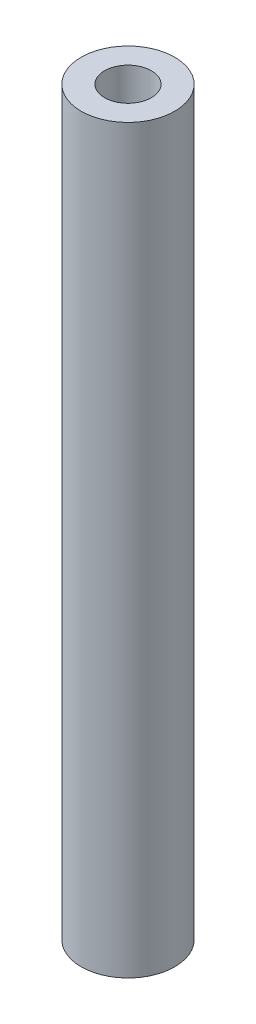
ISO-10303-21;
HEADER;
FILE_DESCRIPTION(('STEP AP214'),'2;1');
FILE_NAME('part.step','',(''),(''),'','','');
FILE_SCHEMA(('AUTOMOTIVE_DESIGN { 1 0 10303 214 1 1 1 1 }'));
ENDSEC;
DATA;
#1=APPLICATION_CONTEXT('core data for automotive mechanical design processes');
#2=APPLICATION_PROTOCOL_DEFINITION('international standard','automotive_design',2000,#1);
#3=PRODUCT_CONTEXT('',#1,'mechanical');
#4=PRODUCT('Part','Part','',(#3));
#5=PRODUCT_RELATED_PRODUCT_CATEGORY('part','',(#4));
#6=PRODUCT_DEFINITION_FORMATION('','',#4);
#7=PRODUCT_DEFINITION_CONTEXT('part definition',#1,'design');
#8=PRODUCT_DEFINITION('design','',#6,#7);
#9=PRODUCT_DEFINITION_SHAPE('','',#8);
#10=(LENGTH_UNIT() NAMED_UNIT(*) SI_UNIT(.MILLI.,.METRE.));
#11=(NAMED_UNIT(*) PLANE_ANGLE_UNIT() SI_UNIT($,.RADIAN.));
#12=(NAMED_UNIT(*) SI_UNIT($,.STERADIAN.) SOLID_ANGLE_UNIT());
#13=UNCERTAINTY_MEASURE_WITH_UNIT(LENGTH_MEASURE(1.E-05),#10,'distance_accuracy_value','');
#14=(GEOMETRIC_REPRESENTATION_CONTEXT(3) GLOBAL_UNCERTAINTY_ASSIGNED_CONTEXT((#13)) GLOBAL_UNIT_ASSIGNED_CONTEXT((#10,
#11,#12)) REPRESENTATION_CONTEXT('',''));
#15=CARTESIAN_POINT('',(0.,0.,0.));
#16=DIRECTION('',(0.,0.,1.));
#17=DIRECTION('',(1.,0.,0.));
#18=AXIS2_PLACEMENT_3D('',#15,#16,#17);
#19=CARTESIAN_POINT('',(0.,95.,0.));
#20=DIRECTION('',(0.,1.,0.));
#21=DIRECTION('',(0.,0.,1.));
#22=AXIS2_PLACEMENT_3D('',#19,#20,#21);
#23=PLANE('',#22);
#24=CARTESIAN_POINT('',(0.,95.,0.));
#25=DIRECTION('',(0.,1.,0.));
#26=DIRECTION('',(0.,0.,1.));
#27=AXIS2_PLACEMENT_3D('',#24,#25,#26);
#28=CIRCLE('',#27,6.);
#29=CARTESIAN_POINT('',(0.,95.,6.));
#30=VERTEX_POINT('',#29);
#31=EDGE_CURVE('E10',#30,#30,#28,.T.);
#32=ORIENTED_EDGE('',*,*,#31,.T.);
#33=EDGE_LOOP('',(#32));
#34=FACE_BOUND('',#33,.T.);
#35=CARTESIAN_POINT('',(0.,95.,0.));
#36=DIRECTION('',(0.,1.,0.));
#37=DIRECTION('',(0.,0.,1.));
#38=AXIS2_PLACEMENT_3D('',#35,#36,#37);
#39=CIRCLE('',#38,3.);
#40=CARTESIAN_POINT('',(0.,95.,3.));
#41=VERTEX_POINT('',#40);
#42=EDGE_CURVE('E42',#41,#41,#39,.T.);
#43=ORIENTED_EDGE('',*,*,#42,.F.);
#44=EDGE_LOOP('',(#43));
#45=FACE_BOUND('',#44,.T.);
#46=ADVANCED_FACE('F31',(#34,#45),#23,.T.);
#47=CARTESIAN_POINT('',(0.,0.,0.));
#48=DIRECTION('',(0.,1.,0.));
#49=DIRECTION('',(0.,0.,1.));
#50=AXIS2_PLACEMENT_3D('',#47,#48,#49);
#51=PLANE('',#50);
#52=CARTESIAN_POINT('',(0.,0.,0.));
#53=DIRECTION('',(0.,1.,0.));
#54=DIRECTION('',(0.,0.,1.));
#55=AXIS2_PLACEMENT_3D('',#52,#53,#54);
#56=CIRCLE('',#55,6.);
#57=CARTESIAN_POINT('',(0.,0.,6.));
#58=VERTEX_POINT('',#57);
#59=EDGE_CURVE('E35',#58,#58,#56,.T.);
#60=ORIENTED_EDGE('',*,*,#59,.F.);
#61=EDGE_LOOP('',(#60));
#62=FACE_BOUND('',#61,.T.);
#63=CARTESIAN_POINT('',(0.,0.,0.));
#64=DIRECTION('',(0.,1.,0.));
#65=DIRECTION('',(0.,0.,1.));
#66=AXIS2_PLACEMENT_3D('',#63,#64,#65);
#67=CIRCLE('',#66,3.);
#68=CARTESIAN_POINT('',(0.,0.,3.));
#69=VERTEX_POINT('',#68);
#70=EDGE_CURVE('E44',#69,#69,#67,.T.);
#71=ORIENTED_EDGE('',*,*,#70,.T.);
#72=EDGE_LOOP('',(#71));
#73=FACE_BOUND('',#72,.T.);
#74=ADVANCED_FACE('F54',(#62,#73),#51,.F.);
#75=CARTESIAN_POINT('',(0.,95.,0.));
#76=DIRECTION('',(0.,-1.,0.));
#77=DIRECTION('',(0.,0.,-1.));
#78=AXIS2_PLACEMENT_3D('',#75,#76,#77);
#79=CYLINDRICAL_SURFACE('',#78,6.);
#80=ORIENTED_EDGE('',*,*,#31,.F.);
#81=EDGE_LOOP('',(#80));
#82=FACE_BOUND('',#81,.T.);
#83=ORIENTED_EDGE('',*,*,#59,.T.);
#84=EDGE_LOOP('',(#83));
#85=FACE_BOUND('',#84,.T.);
#86=ADVANCED_FACE('F33',(#82,#85),#79,.T.);
#87=CARTESIAN_POINT('',(0.,95.,0.));
#88=DIRECTION('',(0.,-1.,0.));
#89=DIRECTION('',(0.,0.,-1.));
#90=AXIS2_PLACEMENT_3D('',#87,#88,#89);
#91=CYLINDRICAL_SURFACE('',#90,3.);
#92=ORIENTED_EDGE('',*,*,#42,.T.);
#93=EDGE_LOOP('',(#92));
#94=FACE_BOUND('',#93,.T.);
#95=ORIENTED_EDGE('',*,*,#70,.F.);
#96=EDGE_LOOP('',(#95));
#97=FACE_BOUND('',#96,.T.);
#98=ADVANCED_FACE('F50',(#94,#97),#91,.F.);
#99=CLOSED_SHELL('',(#46,#74,#86,#98));
#100=MANIFOLD_SOLID_BREP('B2',#99);
#101=ADVANCED_BREP_SHAPE_REPRESENTATION('',(#18,#100),#14);
#102=SHAPE_DEFINITION_REPRESENTATION(#9,#101);
ENDSEC;
END-ISO-10303-21;
